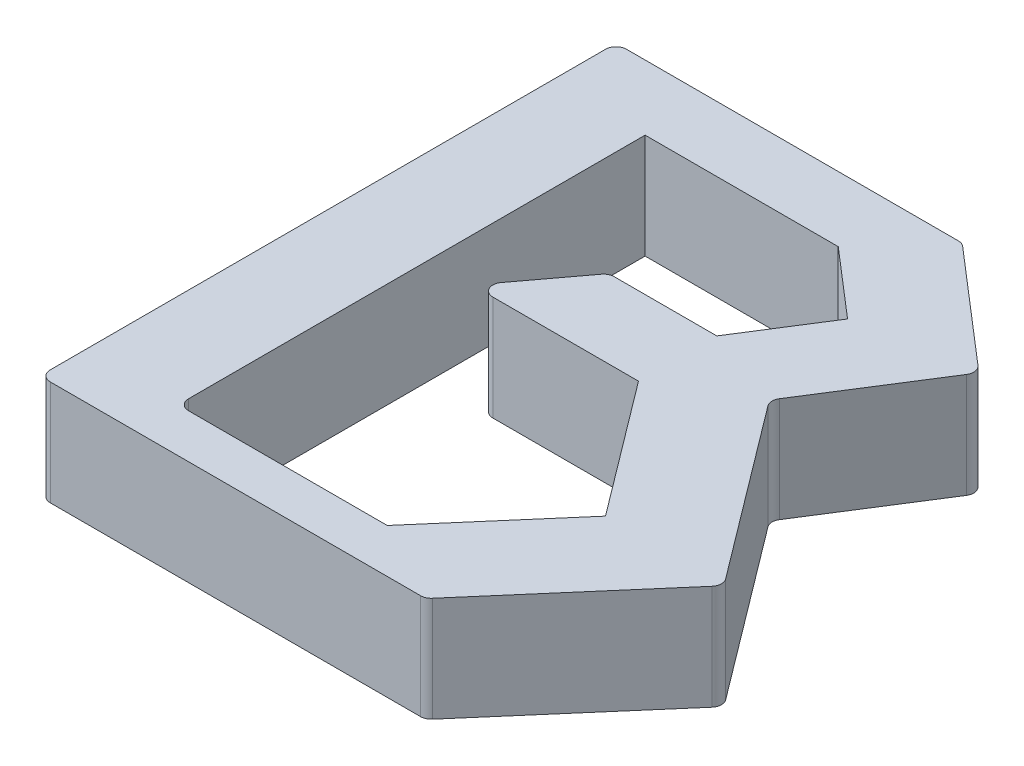
ISO-10303-21;
HEADER;
FILE_DESCRIPTION(('STEP AP214'),'2;1');
FILE_NAME('part.step','',(''),(''),'','','');
FILE_SCHEMA(('AUTOMOTIVE_DESIGN { 1 0 10303 214 1 1 1 1 }'));
ENDSEC;
DATA;
#1=APPLICATION_CONTEXT('core data for automotive mechanical design processes');
#2=APPLICATION_PROTOCOL_DEFINITION('international standard','automotive_design',2000,#1);
#3=PRODUCT_CONTEXT('',#1,'mechanical');
#4=PRODUCT('Part','Part','',(#3));
#5=PRODUCT_RELATED_PRODUCT_CATEGORY('part','',(#4));
#6=PRODUCT_DEFINITION_FORMATION('','',#4);
#7=PRODUCT_DEFINITION_CONTEXT('part definition',#1,'design');
#8=PRODUCT_DEFINITION('design','',#6,#7);
#9=PRODUCT_DEFINITION_SHAPE('','',#8);
#10=(LENGTH_UNIT() NAMED_UNIT(*) SI_UNIT(.MILLI.,.METRE.));
#11=(NAMED_UNIT(*) PLANE_ANGLE_UNIT() SI_UNIT($,.RADIAN.));
#12=(NAMED_UNIT(*) SI_UNIT($,.STERADIAN.) SOLID_ANGLE_UNIT());
#13=UNCERTAINTY_MEASURE_WITH_UNIT(LENGTH_MEASURE(1.E-05),#10,'distance_accuracy_value','');
#14=(GEOMETRIC_REPRESENTATION_CONTEXT(3) GLOBAL_UNCERTAINTY_ASSIGNED_CONTEXT((#13)) GLOBAL_UNIT_ASSIGNED_CONTEXT((#10,
#11,#12)) REPRESENTATION_CONTEXT('',''));
#15=CARTESIAN_POINT('',(0.,0.,0.));
#16=DIRECTION('',(0.,0.,1.));
#17=DIRECTION('',(1.,0.,0.));
#18=AXIS2_PLACEMENT_3D('',#15,#16,#17);
#19=CARTESIAN_POINT('',(0.,10.,0.));
#20=DIRECTION('',(0.,-1.,0.));
#21=DIRECTION('',(0.,0.,-1.));
#22=AXIS2_PLACEMENT_3D('',#19,#20,#21);
#23=PLANE('',#22);
#24=DIRECTION('',(0.534870419899119,0.,-0.844934100339749));
#25=VECTOR('',#24,1.);
#26=CARTESIAN_POINT('',(44.5679123680884,10.,-45.0706105082823));
#27=LINE('',#26,#25);
#28=CARTESIAN_POINT('',(37.1841867720434,10.,-33.4065488747627));
#29=VERTEX_POINT('',#28);
#30=CARTESIAN_POINT('',(44.1063470889876,10.,-44.3414764426546));
#31=VERTEX_POINT('',#30);
#32=EDGE_CURVE('E307',#29,#31,#27,.T.);
#33=ORIENTED_EDGE('',*,*,#32,.T.);
#34=CARTESIAN_POINT('',(43.2614129886479,10.,-44.8763468625537));
#35=DIRECTION('',(0.,-1.,0.));
#36=DIRECTION('',(0.,0.,-1.));
#37=AXIS2_PLACEMENT_3D('',#34,#35,#36);
#38=CIRCLE('',#37,1.);
#39=CARTESIAN_POINT('',(43.9141748943175,10.,-45.6339099916106));
#40=VERTEX_POINT('',#39);
#41=EDGE_CURVE('E375',#31,#40,#38,.F.);
#42=ORIENTED_EDGE('',*,*,#41,.T.);
#43=DIRECTION('',(-0.757563129056951,0.,-0.652761905669626));
#44=VECTOR('',#43,1.);
#45=CARTESIAN_POINT('',(33.0443548387097,10.,-55.));
#46=LINE('',#45,#44);
#47=CARTESIAN_POINT('',(33.3257150604922,10.,-54.7575631290569));
#48=VERTEX_POINT('',#47);
#49=EDGE_CURVE('E310',#40,#48,#46,.T.);
#50=ORIENTED_EDGE('',*,*,#49,.T.);
#51=CARTESIAN_POINT('',(32.6729531548226,10.,-54.));
#52=DIRECTION('',(0.,-1.,0.));
#53=DIRECTION('',(0.,0.,-1.));
#54=AXIS2_PLACEMENT_3D('',#51,#52,#53);
#55=CIRCLE('',#54,1.);
#56=CARTESIAN_POINT('',(32.6729531548226,10.,-55.));
#57=VERTEX_POINT('',#56);
#58=EDGE_CURVE('E361',#48,#57,#55,.F.);
#59=ORIENTED_EDGE('',*,*,#58,.T.);
#60=DIRECTION('',(-1.,0.,0.));
#61=VECTOR('',#60,1.);
#62=CARTESIAN_POINT('',(0.,10.,-55.));
#63=LINE('',#62,#61);
#64=CARTESIAN_POINT('',(1.,10.,-55.));
#65=VERTEX_POINT('',#64);
#66=EDGE_CURVE('E313',#57,#65,#63,.T.);
#67=ORIENTED_EDGE('',*,*,#66,.T.);
#68=CARTESIAN_POINT('',(1.,10.,-54.));
#69=DIRECTION('',(0.,-1.,0.));
#70=DIRECTION('',(0.,0.,-1.));
#71=AXIS2_PLACEMENT_3D('',#68,#69,#70);
#72=CIRCLE('',#71,1.);
#73=CARTESIAN_POINT('',(0.,10.,-54.));
#74=VERTEX_POINT('',#73);
#75=EDGE_CURVE('E363',#65,#74,#72,.F.);
#76=ORIENTED_EDGE('',*,*,#75,.T.);
#77=DIRECTION('',(0.,0.,1.));
#78=VECTOR('',#77,1.);
#79=CARTESIAN_POINT('',(0.,10.,0.));
#80=LINE('',#79,#78);
#81=CARTESIAN_POINT('',(0.,10.,-1.));
#82=VERTEX_POINT('',#81);
#83=EDGE_CURVE('E294',#74,#82,#80,.T.);
#84=ORIENTED_EDGE('',*,*,#83,.T.);
#85=CARTESIAN_POINT('',(1.,10.,-1.));
#86=DIRECTION('',(0.,-1.,0.));
#87=DIRECTION('',(0.,0.,-1.));
#88=AXIS2_PLACEMENT_3D('',#85,#86,#87);
#89=CIRCLE('',#88,1.);
#90=CARTESIAN_POINT('',(1.,10.,0.));
#91=VERTEX_POINT('',#90);
#92=EDGE_CURVE('E365',#82,#91,#89,.F.);
#93=ORIENTED_EDGE('',*,*,#92,.T.);
#94=DIRECTION('',(1.,0.,0.));
#95=VECTOR('',#94,1.);
#96=CARTESIAN_POINT('',(0.,10.,0.));
#97=LINE('',#96,#95);
#98=CARTESIAN_POINT('',(36.3561542037857,10.,0.));
#99=VERTEX_POINT('',#98);
#100=EDGE_CURVE('E297',#91,#99,#97,.T.);
#101=ORIENTED_EDGE('',*,*,#100,.T.);
#102=CARTESIAN_POINT('',(36.3561542037857,10.,-1.));
#103=DIRECTION('',(0.,-1.,0.));
#104=DIRECTION('',(0.,0.,-1.));
#105=AXIS2_PLACEMENT_3D('',#102,#103,#104);
#106=CIRCLE('',#105,1.);
#107=CARTESIAN_POINT('',(37.1137173328426,10.,-0.347238094330377));
#108=VERTEX_POINT('',#107);
#109=EDGE_CURVE('E373',#99,#108,#106,.F.);
#110=ORIENTED_EDGE('',*,*,#109,.T.);
#111=DIRECTION('',(0.652761905669626,0.,-0.757563129056951));
#112=VECTOR('',#111,1.);
#113=CARTESIAN_POINT('',(50.,10.,-15.3024193548387));
#114=LINE('',#113,#112);
#115=CARTESIAN_POINT('',(49.4740875818952,10.,-14.6920714567629));
#116=VERTEX_POINT('',#115);
#117=EDGE_CURVE('E301',#108,#116,#114,.T.);
#118=ORIENTED_EDGE('',*,*,#117,.T.);
#119=CARTESIAN_POINT('',(48.7165244528382,10.,-15.3448333624326));
#120=DIRECTION('',(0.,-1.,0.));
#121=DIRECTION('',(0.,0.,-1.));
#122=AXIS2_PLACEMENT_3D('',#119,#120,#121);
#123=CIRCLE('',#122,1.);
#124=CARTESIAN_POINT('',(49.5155303464269,10.,-15.9461565550758));
#125=VERTEX_POINT('',#124);
#126=EDGE_CURVE('E371',#116,#125,#123,.F.);
#127=ORIENTED_EDGE('',*,*,#126,.T.);
#128=DIRECTION('',(-0.601323192643225,0.,-0.799005893588626));
#129=VECTOR('',#128,1.);
#130=CARTESIAN_POINT('',(36.8145161290322,10.,-32.8225806451613));
#131=LINE('',#130,#129);
#132=CARTESIAN_POINT('',(37.2301149787945,10.,-32.2703552622203));
#133=VERTEX_POINT('',#132);
#134=EDGE_CURVE('E304',#125,#133,#131,.T.);
#135=ORIENTED_EDGE('',*,*,#134,.T.);
#136=CARTESIAN_POINT('',(38.0291208723831,10.,-32.8716784548635));
#137=DIRECTION('',(0.,-1.,0.));
#138=DIRECTION('',(0.,0.,-1.));
#139=AXIS2_PLACEMENT_3D('',#136,#137,#138);
#140=CIRCLE('',#139,1.);
#141=EDGE_CURVE('E417',#133,#29,#140,.T.);
#142=ORIENTED_EDGE('',*,*,#141,.T.);
#143=EDGE_LOOP('',(#33,#42,#50,#59,#67,#76,#84,#93,#101,#110,#118,#127,#135,#142));
#144=FACE_BOUND('',#143,.T.);
#145=DIRECTION('',(0.599203550404708,0.,-0.800596718193619));
#146=VECTOR('',#145,1.);
#147=CARTESIAN_POINT('',(13.1098148707565,10.,-28.1359668027432));
#148=LINE('',#147,#146);
#149=CARTESIAN_POINT('',(14.3067326490162,10.,-29.7351703531479));
#150=VERTEX_POINT('',#149);
#151=CARTESIAN_POINT('',(18.4049889788777,10.,-35.2108564798194));
#152=VERTEX_POINT('',#151);
#153=EDGE_CURVE('E248',#150,#152,#148,.T.);
#154=ORIENTED_EDGE('',*,*,#153,.F.);
#155=CARTESIAN_POINT('',(15.1073293672098,10.,-29.1359668027432));
#156=DIRECTION('',(0.,-1.,0.));
#157=DIRECTION('',(0.,0.,-1.));
#158=AXIS2_PLACEMENT_3D('',#155,#156,#157);
#159=CIRCLE('',#158,1.);
#160=CARTESIAN_POINT('',(15.1073293672098,10.,-28.1359668027432));
#161=VERTEX_POINT('',#160);
#162=EDGE_CURVE('E369',#150,#161,#159,.F.);
#163=ORIENTED_EDGE('',*,*,#162,.T.);
#164=DIRECTION('',(-1.,0.,0.));
#165=VECTOR('',#164,1.);
#166=CARTESIAN_POINT('',(13.1098148707565,10.,-28.1359668027432));
#167=LINE('',#166,#165);
#168=CARTESIAN_POINT('',(29.007221013889,10.,-28.1359668027432));
#169=VERTEX_POINT('',#168);
#170=EDGE_CURVE('E245',#169,#161,#167,.T.);
#171=ORIENTED_EDGE('',*,*,#170,.F.);
#172=DIRECTION('',(-0.601323192643225,0.,-0.799005893588627));
#173=VECTOR('',#172,1.);
#174=CARTESIAN_POINT('',(29.007221013889,10.,-28.1359668027432));
#175=LINE('',#174,#173);
#176=CARTESIAN_POINT('',(38.5894668716284,10.,-15.4035942486522));
#177=VERTEX_POINT('',#176);
#178=EDGE_CURVE('E243',#177,#169,#175,.T.);
#179=ORIENTED_EDGE('',*,*,#178,.F.);
#180=DIRECTION('',(0.652761905669626,0.,-0.757563129056951));
#181=VECTOR('',#180,1.);
#182=CARTESIAN_POINT('',(38.5894668716284,10.,-15.4035942486522));
#183=LINE('',#182,#181);
#184=CARTESIAN_POINT('',(28.947590047404,10.,-4.21370967741935));
#185=VERTEX_POINT('',#184);
#186=EDGE_CURVE('E239',#185,#177,#183,.T.);
#187=ORIENTED_EDGE('',*,*,#186,.F.);
#188=DIRECTION('',(1.,0.,0.));
#189=VECTOR('',#188,1.);
#190=CARTESIAN_POINT('',(28.947590047404,10.,-4.21370967741935));
#191=LINE('',#190,#189);
#192=CARTESIAN_POINT('',(9.9879126280492,10.,-4.21370967741935));
#193=VERTEX_POINT('',#192);
#194=EDGE_CURVE('E237',#193,#185,#191,.T.);
#195=ORIENTED_EDGE('',*,*,#194,.F.);
#196=CARTESIAN_POINT('',(9.98791262804919,10.,-5.21370967741935));
#197=DIRECTION('',(0.,-1.,0.));
#198=DIRECTION('',(0.,0.,-1.));
#199=AXIS2_PLACEMENT_3D('',#196,#197,#198);
#200=CIRCLE('',#199,1.);
#201=CARTESIAN_POINT('',(8.98791262804919,10.,-5.21370967741935));
#202=VERTEX_POINT('',#201);
#203=EDGE_CURVE('E11',#193,#202,#200,.T.);
#204=ORIENTED_EDGE('',*,*,#203,.T.);
#205=DIRECTION('',(0.,0.,1.));
#206=VECTOR('',#205,1.);
#207=CARTESIAN_POINT('',(8.98791262804918,10.,-48.7885141245915));
#208=LINE('',#207,#206);
#209=CARTESIAN_POINT('',(8.98791262804918,10.,-48.7885141245915));
#210=VERTEX_POINT('',#209);
#211=EDGE_CURVE('E224',#210,#202,#208,.T.);
#212=ORIENTED_EDGE('',*,*,#211,.F.);
#213=DIRECTION('',(-1.,0.,0.));
#214=VECTOR('',#213,1.);
#215=CARTESIAN_POINT('',(8.98791262804918,10.,-48.7885141245915));
#216=LINE('',#215,#214);
#217=CARTESIAN_POINT('',(27.4217174133645,10.,-48.7885141245915));
#218=VERTEX_POINT('',#217);
#219=EDGE_CURVE('E216',#218,#210,#216,.T.);
#220=ORIENTED_EDGE('',*,*,#219,.F.);
#221=DIRECTION('',(-0.757563129056952,0.,-0.652761905669625));
#222=VECTOR('',#221,1.);
#223=CARTESIAN_POINT('',(27.4217174133645,10.,-48.7885141245915));
#224=LINE('',#223,#222);
#225=CARTESIAN_POINT('',(33.8449762012233,10.,-43.2538484496776));
#226=VERTEX_POINT('',#225);
#227=EDGE_CURVE('E256',#226,#218,#224,.T.);
#228=ORIENTED_EDGE('',*,*,#227,.F.);
#229=DIRECTION('',(0.534870419899118,0.,-0.844934100339749));
#230=VECTOR('',#229,1.);
#231=CARTESIAN_POINT('',(33.8449762012233,10.,-43.2538484496776));
#232=LINE('',#231,#230);
#233=CARTESIAN_POINT('',(29.007221013889,10.,-35.6116529294147));
#234=VERTEX_POINT('',#233);
#235=EDGE_CURVE('E253',#234,#226,#232,.T.);
#236=ORIENTED_EDGE('',*,*,#235,.F.);
#237=DIRECTION('',(1.,0.,0.));
#238=VECTOR('',#237,1.);
#239=CARTESIAN_POINT('',(29.007221013889,10.,-35.6116529294147));
#240=LINE('',#239,#238);
#241=CARTESIAN_POINT('',(19.2055856970713,10.,-35.6116529294147));
#242=VERTEX_POINT('',#241);
#243=EDGE_CURVE('E251',#242,#234,#240,.T.);
#244=ORIENTED_EDGE('',*,*,#243,.F.);
#245=CARTESIAN_POINT('',(19.2055856970713,10.,-34.6116529294147));
#246=DIRECTION('',(0.,-1.,0.));
#247=DIRECTION('',(0.,0.,-1.));
#248=AXIS2_PLACEMENT_3D('',#245,#246,#247);
#249=CIRCLE('',#248,1.);
#250=EDGE_CURVE('E367',#242,#152,#249,.F.);
#251=ORIENTED_EDGE('',*,*,#250,.T.);
#252=EDGE_LOOP('',(#154,#163,#171,#179,#187,#195,#204,#212,#220,#228,#236,#244,#251));
#253=FACE_BOUND('',#252,.T.);
#254=ADVANCED_FACE('F36',(#144,#253),#23,.F.);
#255=CARTESIAN_POINT('',(0.,0.,0.));
#256=DIRECTION('',(0.,-1.,0.));
#257=DIRECTION('',(0.,0.,-1.));
#258=AXIS2_PLACEMENT_3D('',#255,#256,#257);
#259=PLANE('',#258);
#260=DIRECTION('',(-0.757563129056951,0.,-0.652761905669626));
#261=VECTOR('',#260,1.);
#262=CARTESIAN_POINT('',(33.0443548387097,0.,-55.));
#263=LINE('',#262,#261);
#264=CARTESIAN_POINT('',(43.9141748943175,0.,-45.6339099916106));
#265=VERTEX_POINT('',#264);
#266=CARTESIAN_POINT('',(33.3257150604922,0.,-54.7575631290569));
#267=VERTEX_POINT('',#266);
#268=EDGE_CURVE('E331',#265,#267,#263,.T.);
#269=ORIENTED_EDGE('',*,*,#268,.F.);
#270=CARTESIAN_POINT('',(43.2614129886479,0.,-44.8763468625537));
#271=DIRECTION('',(0.,-1.,0.));
#272=DIRECTION('',(0.,0.,-1.));
#273=AXIS2_PLACEMENT_3D('',#270,#271,#272);
#274=CIRCLE('',#273,1.);
#275=CARTESIAN_POINT('',(44.1063470889876,0.,-44.3414764426546));
#276=VERTEX_POINT('',#275);
#277=EDGE_CURVE('E354',#265,#276,#274,.T.);
#278=ORIENTED_EDGE('',*,*,#277,.T.);
#279=DIRECTION('',(0.534870419899119,0.,-0.844934100339749));
#280=VECTOR('',#279,1.);
#281=CARTESIAN_POINT('',(44.5679123680884,0.,-45.0706105082823));
#282=LINE('',#281,#280);
#283=CARTESIAN_POINT('',(37.1841867720434,0.,-33.4065488747627));
#284=VERTEX_POINT('',#283);
#285=EDGE_CURVE('E328',#284,#276,#282,.T.);
#286=ORIENTED_EDGE('',*,*,#285,.F.);
#287=CARTESIAN_POINT('',(38.0291208723831,0.,-32.8716784548635));
#288=DIRECTION('',(0.,-1.,0.));
#289=DIRECTION('',(0.,0.,-1.));
#290=AXIS2_PLACEMENT_3D('',#287,#288,#289);
#291=CIRCLE('',#290,1.);
#292=CARTESIAN_POINT('',(37.2301149787945,0.,-32.2703552622203));
#293=VERTEX_POINT('',#292);
#294=EDGE_CURVE('E415',#284,#293,#291,.F.);
#295=ORIENTED_EDGE('',*,*,#294,.T.);
#296=DIRECTION('',(-0.601323192643225,0.,-0.799005893588626));
#297=VECTOR('',#296,1.);
#298=CARTESIAN_POINT('',(36.8145161290322,0.,-32.8225806451613));
#299=LINE('',#298,#297);
#300=CARTESIAN_POINT('',(49.5155303464269,0.,-15.9461565550758));
#301=VERTEX_POINT('',#300);
#302=EDGE_CURVE('E325',#301,#293,#299,.T.);
#303=ORIENTED_EDGE('',*,*,#302,.F.);
#304=CARTESIAN_POINT('',(48.7165244528382,0.,-15.3448333624326));
#305=DIRECTION('',(0.,-1.,0.));
#306=DIRECTION('',(0.,0.,-1.));
#307=AXIS2_PLACEMENT_3D('',#304,#305,#306);
#308=CIRCLE('',#307,1.);
#309=CARTESIAN_POINT('',(49.4740875818952,0.,-14.6920714567629));
#310=VERTEX_POINT('',#309);
#311=EDGE_CURVE('E350',#301,#310,#308,.T.);
#312=ORIENTED_EDGE('',*,*,#311,.T.);
#313=DIRECTION('',(0.652761905669626,0.,-0.757563129056951));
#314=VECTOR('',#313,1.);
#315=CARTESIAN_POINT('',(50.,0.,-15.3024193548387));
#316=LINE('',#315,#314);
#317=CARTESIAN_POINT('',(37.1137173328426,0.,-0.347238094330377));
#318=VERTEX_POINT('',#317);
#319=EDGE_CURVE('E322',#318,#310,#316,.T.);
#320=ORIENTED_EDGE('',*,*,#319,.F.);
#321=CARTESIAN_POINT('',(36.3561542037857,0.,-1.));
#322=DIRECTION('',(0.,-1.,0.));
#323=DIRECTION('',(0.,0.,-1.));
#324=AXIS2_PLACEMENT_3D('',#321,#322,#323);
#325=CIRCLE('',#324,1.);
#326=CARTESIAN_POINT('',(36.3561542037857,0.,0.));
#327=VERTEX_POINT('',#326);
#328=EDGE_CURVE('E352',#318,#327,#325,.T.);
#329=ORIENTED_EDGE('',*,*,#328,.T.);
#330=DIRECTION('',(1.,0.,0.));
#331=VECTOR('',#330,1.);
#332=CARTESIAN_POINT('',(0.,0.,0.));
#333=LINE('',#332,#331);
#334=CARTESIAN_POINT('',(1.,0.,0.));
#335=VERTEX_POINT('',#334);
#336=EDGE_CURVE('E319',#335,#327,#333,.T.);
#337=ORIENTED_EDGE('',*,*,#336,.F.);
#338=CARTESIAN_POINT('',(1.,0.,-1.));
#339=DIRECTION('',(0.,-1.,0.));
#340=DIRECTION('',(0.,0.,-1.));
#341=AXIS2_PLACEMENT_3D('',#338,#339,#340);
#342=CIRCLE('',#341,1.);
#343=CARTESIAN_POINT('',(0.,0.,-1.));
#344=VERTEX_POINT('',#343);
#345=EDGE_CURVE('E344',#335,#344,#342,.T.);
#346=ORIENTED_EDGE('',*,*,#345,.T.);
#347=DIRECTION('',(0.,0.,1.));
#348=VECTOR('',#347,1.);
#349=CARTESIAN_POINT('',(0.,0.,0.));
#350=LINE('',#349,#348);
#351=CARTESIAN_POINT('',(0.,0.,-54.));
#352=VERTEX_POINT('',#351);
#353=EDGE_CURVE('E233',#352,#344,#350,.T.);
#354=ORIENTED_EDGE('',*,*,#353,.F.);
#355=CARTESIAN_POINT('',(1.,0.,-54.));
#356=DIRECTION('',(0.,-1.,0.));
#357=DIRECTION('',(0.,0.,-1.));
#358=AXIS2_PLACEMENT_3D('',#355,#356,#357);
#359=CIRCLE('',#358,1.);
#360=CARTESIAN_POINT('',(1.,0.,-55.));
#361=VERTEX_POINT('',#360);
#362=EDGE_CURVE('E342',#352,#361,#359,.T.);
#363=ORIENTED_EDGE('',*,*,#362,.T.);
#364=DIRECTION('',(-1.,0.,0.));
#365=VECTOR('',#364,1.);
#366=CARTESIAN_POINT('',(0.,0.,-55.));
#367=LINE('',#366,#365);
#368=CARTESIAN_POINT('',(32.6729531548226,0.,-55.));
#369=VERTEX_POINT('',#368);
#370=EDGE_CURVE('E298',#369,#361,#367,.T.);
#371=ORIENTED_EDGE('',*,*,#370,.F.);
#372=CARTESIAN_POINT('',(32.6729531548226,0.,-54.));
#373=DIRECTION('',(0.,-1.,0.));
#374=DIRECTION('',(0.,0.,-1.));
#375=AXIS2_PLACEMENT_3D('',#372,#373,#374);
#376=CIRCLE('',#375,1.);
#377=EDGE_CURVE('E340',#369,#267,#376,.T.);
#378=ORIENTED_EDGE('',*,*,#377,.T.);
#379=EDGE_LOOP('',(#269,#278,#286,#295,#303,#312,#320,#329,#337,#346,#354,#363,#371,#378));
#380=FACE_BOUND('',#379,.T.);
#381=DIRECTION('',(-1.,0.,0.));
#382=VECTOR('',#381,1.);
#383=CARTESIAN_POINT('',(13.1098148707565,0.,-28.1359668027432));
#384=LINE('',#383,#382);
#385=CARTESIAN_POINT('',(29.007221013889,0.,-28.1359668027432));
#386=VERTEX_POINT('',#385);
#387=CARTESIAN_POINT('',(15.1073293672098,0.,-28.1359668027432));
#388=VERTEX_POINT('',#387);
#389=EDGE_CURVE('E269',#386,#388,#384,.T.);
#390=ORIENTED_EDGE('',*,*,#389,.T.);
#391=CARTESIAN_POINT('',(15.1073293672098,0.,-29.1359668027432));
#392=DIRECTION('',(0.,-1.,0.));
#393=DIRECTION('',(0.,0.,-1.));
#394=AXIS2_PLACEMENT_3D('',#391,#392,#393);
#395=CIRCLE('',#394,1.);
#396=CARTESIAN_POINT('',(14.3067326490162,0.,-29.7351703531479));
#397=VERTEX_POINT('',#396);
#398=EDGE_CURVE('E348',#388,#397,#395,.T.);
#399=ORIENTED_EDGE('',*,*,#398,.T.);
#400=DIRECTION('',(0.599203550404708,0.,-0.800596718193619));
#401=VECTOR('',#400,1.);
#402=CARTESIAN_POINT('',(13.1098148707565,0.,-28.1359668027432));
#403=LINE('',#402,#401);
#404=CARTESIAN_POINT('',(18.4049889788777,0.,-35.2108564798194));
#405=VERTEX_POINT('',#404);
#406=EDGE_CURVE('E272',#397,#405,#403,.T.);
#407=ORIENTED_EDGE('',*,*,#406,.T.);
#408=CARTESIAN_POINT('',(19.2055856970713,0.,-34.6116529294147));
#409=DIRECTION('',(0.,-1.,0.));
#410=DIRECTION('',(0.,0.,-1.));
#411=AXIS2_PLACEMENT_3D('',#408,#409,#410);
#412=CIRCLE('',#411,1.);
#413=CARTESIAN_POINT('',(19.2055856970713,0.,-35.6116529294147));
#414=VERTEX_POINT('',#413);
#415=EDGE_CURVE('E346',#405,#414,#412,.T.);
#416=ORIENTED_EDGE('',*,*,#415,.T.);
#417=DIRECTION('',(1.,0.,0.));
#418=VECTOR('',#417,1.);
#419=CARTESIAN_POINT('',(29.007221013889,0.,-35.6116529294147));
#420=LINE('',#419,#418);
#421=CARTESIAN_POINT('',(29.007221013889,0.,-35.6116529294147));
#422=VERTEX_POINT('',#421);
#423=EDGE_CURVE('E275',#414,#422,#420,.T.);
#424=ORIENTED_EDGE('',*,*,#423,.T.);
#425=DIRECTION('',(0.534870419899118,0.,-0.844934100339749));
#426=VECTOR('',#425,1.);
#427=CARTESIAN_POINT('',(33.8449762012233,0.,-43.2538484496776));
#428=LINE('',#427,#426);
#429=CARTESIAN_POINT('',(33.8449762012233,0.,-43.2538484496776));
#430=VERTEX_POINT('',#429);
#431=EDGE_CURVE('E277',#422,#430,#428,.T.);
#432=ORIENTED_EDGE('',*,*,#431,.T.);
#433=DIRECTION('',(-0.757563129056952,0.,-0.652761905669625));
#434=VECTOR('',#433,1.);
#435=CARTESIAN_POINT('',(27.4217174133645,0.,-48.7885141245915));
#436=LINE('',#435,#434);
#437=CARTESIAN_POINT('',(27.4217174133645,0.,-48.7885141245915));
#438=VERTEX_POINT('',#437);
#439=EDGE_CURVE('E225',#430,#438,#436,.T.);
#440=ORIENTED_EDGE('',*,*,#439,.T.);
#441=DIRECTION('',(-1.,0.,0.));
#442=VECTOR('',#441,1.);
#443=CARTESIAN_POINT('',(8.98791262804918,0.,-48.7885141245915));
#444=LINE('',#443,#442);
#445=CARTESIAN_POINT('',(8.98791262804918,0.,-48.7885141245915));
#446=VERTEX_POINT('',#445);
#447=EDGE_CURVE('E258',#438,#446,#444,.T.);
#448=ORIENTED_EDGE('',*,*,#447,.T.);
#449=DIRECTION('',(0.,0.,1.));
#450=VECTOR('',#449,1.);
#451=CARTESIAN_POINT('',(8.98791262804918,0.,-48.7885141245915));
#452=LINE('',#451,#450);
#453=CARTESIAN_POINT('',(8.98791262804919,0.,-5.21370967741935));
#454=VERTEX_POINT('',#453);
#455=EDGE_CURVE('E232',#446,#454,#452,.T.);
#456=ORIENTED_EDGE('',*,*,#455,.T.);
#457=CARTESIAN_POINT('',(9.98791262804919,0.,-5.21370967741935));
#458=DIRECTION('',(0.,-1.,0.));
#459=DIRECTION('',(0.,0.,-1.));
#460=AXIS2_PLACEMENT_3D('',#457,#458,#459);
#461=CIRCLE('',#460,1.);
#462=CARTESIAN_POINT('',(9.9879126280492,0.,-4.21370967741935));
#463=VERTEX_POINT('',#462);
#464=EDGE_CURVE('E44',#454,#463,#461,.F.);
#465=ORIENTED_EDGE('',*,*,#464,.T.);
#466=DIRECTION('',(1.,0.,0.));
#467=VECTOR('',#466,1.);
#468=CARTESIAN_POINT('',(28.947590047404,0.,-4.21370967741935));
#469=LINE('',#468,#467);
#470=CARTESIAN_POINT('',(28.947590047404,0.,-4.21370967741935));
#471=VERTEX_POINT('',#470);
#472=EDGE_CURVE('E261',#463,#471,#469,.T.);
#473=ORIENTED_EDGE('',*,*,#472,.T.);
#474=DIRECTION('',(0.652761905669626,0.,-0.757563129056951));
#475=VECTOR('',#474,1.);
#476=CARTESIAN_POINT('',(38.5894668716284,0.,-15.4035942486522));
#477=LINE('',#476,#475);
#478=CARTESIAN_POINT('',(38.5894668716284,0.,-15.4035942486522));
#479=VERTEX_POINT('',#478);
#480=EDGE_CURVE('E263',#471,#479,#477,.T.);
#481=ORIENTED_EDGE('',*,*,#480,.T.);
#482=DIRECTION('',(-0.601323192643225,0.,-0.799005893588627));
#483=VECTOR('',#482,1.);
#484=CARTESIAN_POINT('',(29.007221013889,0.,-28.1359668027432));
#485=LINE('',#484,#483);
#486=EDGE_CURVE('E266',#479,#386,#485,.T.);
#487=ORIENTED_EDGE('',*,*,#486,.T.);
#488=EDGE_LOOP('',(#390,#399,#407,#416,#424,#432,#440,#448,#456,#465,#473,#481,#487));
#489=FACE_BOUND('',#488,.T.);
#490=ADVANCED_FACE('F419',(#380,#489),#259,.T.);
#491=CARTESIAN_POINT('',(0.,10.,0.));
#492=DIRECTION('',(1.,0.,0.));
#493=DIRECTION('',(0.,0.,-1.));
#494=AXIS2_PLACEMENT_3D('',#491,#492,#493);
#495=PLANE('',#494);
#496=ORIENTED_EDGE('',*,*,#353,.T.);
#497=DIRECTION('',(0.,-1.,0.));
#498=VECTOR('',#497,1.);
#499=CARTESIAN_POINT('',(0.,10.,-1.));
#500=LINE('',#499,#498);
#501=EDGE_CURVE('E405',#344,#82,#500,.F.);
#502=ORIENTED_EDGE('',*,*,#501,.T.);
#503=ORIENTED_EDGE('',*,*,#83,.F.);
#504=DIRECTION('',(0.,-1.,0.));
#505=VECTOR('',#504,1.);
#506=CARTESIAN_POINT('',(0.,10.,-54.));
#507=LINE('',#506,#505);
#508=EDGE_CURVE('E402',#74,#352,#507,.T.);
#509=ORIENTED_EDGE('',*,*,#508,.T.);
#510=EDGE_LOOP('',(#496,#502,#503,#509));
#511=FACE_BOUND('',#510,.T.);
#512=ADVANCED_FACE('F437',(#511),#495,.F.);
#513=CARTESIAN_POINT('',(0.,10.,0.));
#514=DIRECTION('',(0.,0.,-1.));
#515=DIRECTION('',(-1.,0.,0.));
#516=AXIS2_PLACEMENT_3D('',#513,#514,#515);
#517=PLANE('',#516);
#518=ORIENTED_EDGE('',*,*,#336,.T.);
#519=DIRECTION('',(0.,-1.,0.));
#520=VECTOR('',#519,1.);
#521=CARTESIAN_POINT('',(36.3561542037857,10.,0.));
#522=LINE('',#521,#520);
#523=EDGE_CURVE('E385',#327,#99,#522,.F.);
#524=ORIENTED_EDGE('',*,*,#523,.T.);
#525=ORIENTED_EDGE('',*,*,#100,.F.);
#526=DIRECTION('',(0.,-1.,0.));
#527=VECTOR('',#526,1.);
#528=CARTESIAN_POINT('',(1.,10.,0.));
#529=LINE('',#528,#527);
#530=EDGE_CURVE('E382',#91,#335,#529,.T.);
#531=ORIENTED_EDGE('',*,*,#530,.T.);
#532=EDGE_LOOP('',(#518,#524,#525,#531));
#533=FACE_BOUND('',#532,.T.);
#534=ADVANCED_FACE('F462',(#533),#517,.F.);
#535=CARTESIAN_POINT('',(50.,10.,-15.3024193548387));
#536=DIRECTION('',(-0.757563129056951,0.,-0.652761905669626));
#537=DIRECTION('',(-0.652761905669626,0.,0.757563129056951));
#538=AXIS2_PLACEMENT_3D('',#535,#536,#537);
#539=PLANE('',#538);
#540=ORIENTED_EDGE('',*,*,#117,.F.);
#541=DIRECTION('',(0.,-1.,0.));
#542=VECTOR('',#541,1.);
#543=CARTESIAN_POINT('',(37.1137173328426,10.,-0.347238094330375));
#544=LINE('',#543,#542);
#545=EDGE_CURVE('E379',#108,#318,#544,.T.);
#546=ORIENTED_EDGE('',*,*,#545,.T.);
#547=ORIENTED_EDGE('',*,*,#319,.T.);
#548=DIRECTION('',(0.,-1.,0.));
#549=VECTOR('',#548,1.);
#550=CARTESIAN_POINT('',(49.4740875818952,10.,-14.6920714567629));
#551=LINE('',#550,#549);
#552=EDGE_CURVE('E377',#310,#116,#551,.F.);
#553=ORIENTED_EDGE('',*,*,#552,.T.);
#554=EDGE_LOOP('',(#540,#546,#547,#553));
#555=FACE_BOUND('',#554,.T.);
#556=ADVANCED_FACE('F458',(#555),#539,.F.);
#557=CARTESIAN_POINT('',(36.8145161290322,10.,-32.8225806451613));
#558=DIRECTION('',(-0.799005893588626,0.,0.601323192643225));
#559=DIRECTION('',(0.601323192643225,0.,0.799005893588626));
#560=AXIS2_PLACEMENT_3D('',#557,#558,#559);
#561=PLANE('',#560);
#562=ORIENTED_EDGE('',*,*,#134,.F.);
#563=DIRECTION('',(0.,-1.,0.));
#564=VECTOR('',#563,1.);
#565=CARTESIAN_POINT('',(49.5155303464269,10.,-15.9461565550758));
#566=LINE('',#565,#564);
#567=EDGE_CURVE('E389',#125,#301,#566,.T.);
#568=ORIENTED_EDGE('',*,*,#567,.T.);
#569=ORIENTED_EDGE('',*,*,#302,.T.);
#570=DIRECTION('',(0.,-1.,0.));
#571=VECTOR('',#570,1.);
#572=CARTESIAN_POINT('',(37.2301149787945,10.,-32.2703552622203));
#573=LINE('',#572,#571);
#574=EDGE_CURVE('E387',#293,#133,#573,.F.);
#575=ORIENTED_EDGE('',*,*,#574,.T.);
#576=EDGE_LOOP('',(#562,#568,#569,#575));
#577=FACE_BOUND('',#576,.T.);
#578=ADVANCED_FACE('F454',(#577),#561,.F.);
#579=CARTESIAN_POINT('',(44.5679123680884,10.,-45.0706105082823));
#580=DIRECTION('',(-0.844934100339749,0.,-0.534870419899119));
#581=DIRECTION('',(-0.534870419899119,0.,0.844934100339749));
#582=AXIS2_PLACEMENT_3D('',#579,#580,#581);
#583=PLANE('',#582);
#584=ORIENTED_EDGE('',*,*,#285,.T.);
#585=DIRECTION('',(0.,-1.,0.));
#586=VECTOR('',#585,1.);
#587=CARTESIAN_POINT('',(44.1063470889876,10.,-44.3414764426546));
#588=LINE('',#587,#586);
#589=EDGE_CURVE('E359',#276,#31,#588,.F.);
#590=ORIENTED_EDGE('',*,*,#589,.T.);
#591=ORIENTED_EDGE('',*,*,#32,.F.);
#592=DIRECTION('',(0.,-1.,0.));
#593=VECTOR('',#592,1.);
#594=CARTESIAN_POINT('',(37.1841867720434,0.,-33.4065488747626));
#595=LINE('',#594,#593);
#596=EDGE_CURVE('E356',#29,#284,#595,.T.);
#597=ORIENTED_EDGE('',*,*,#596,.T.);
#598=EDGE_LOOP('',(#584,#590,#591,#597));
#599=FACE_BOUND('',#598,.T.);
#600=ADVANCED_FACE('F450',(#599),#583,.F.);
#601=CARTESIAN_POINT('',(33.0443548387097,10.,-55.));
#602=DIRECTION('',(-0.652761905669626,0.,0.757563129056951));
#603=DIRECTION('',(0.757563129056951,0.,0.652761905669626));
#604=AXIS2_PLACEMENT_3D('',#601,#602,#603);
#605=PLANE('',#604);
#606=ORIENTED_EDGE('',*,*,#49,.F.);
#607=DIRECTION('',(0.,-1.,0.));
#608=VECTOR('',#607,1.);
#609=CARTESIAN_POINT('',(43.9141748943175,10.,-45.6339099916106));
#610=LINE('',#609,#608);
#611=EDGE_CURVE('E337',#40,#265,#610,.T.);
#612=ORIENTED_EDGE('',*,*,#611,.T.);
#613=ORIENTED_EDGE('',*,*,#268,.T.);
#614=DIRECTION('',(0.,-1.,0.));
#615=VECTOR('',#614,1.);
#616=CARTESIAN_POINT('',(33.3257150604922,10.,-54.7575631290569));
#617=LINE('',#616,#615);
#618=EDGE_CURVE('E316',#267,#48,#617,.F.);
#619=ORIENTED_EDGE('',*,*,#618,.T.);
#620=EDGE_LOOP('',(#606,#612,#613,#619));
#621=FACE_BOUND('',#620,.T.);
#622=ADVANCED_FACE('F446',(#621),#605,.F.);
#623=CARTESIAN_POINT('',(0.,10.,-55.));
#624=DIRECTION('',(0.,0.,1.));
#625=DIRECTION('',(1.,0.,0.));
#626=AXIS2_PLACEMENT_3D('',#623,#624,#625);
#627=PLANE('',#626);
#628=ORIENTED_EDGE('',*,*,#370,.T.);
#629=DIRECTION('',(0.,-1.,0.));
#630=VECTOR('',#629,1.);
#631=CARTESIAN_POINT('',(1.,10.,-55.));
#632=LINE('',#631,#630);
#633=EDGE_CURVE('E410',#361,#65,#632,.F.);
#634=ORIENTED_EDGE('',*,*,#633,.T.);
#635=ORIENTED_EDGE('',*,*,#66,.F.);
#636=DIRECTION('',(0.,-1.,0.));
#637=VECTOR('',#636,1.);
#638=CARTESIAN_POINT('',(32.6729531548226,10.,-55.));
#639=LINE('',#638,#637);
#640=EDGE_CURVE('E407',#57,#369,#639,.T.);
#641=ORIENTED_EDGE('',*,*,#640,.T.);
#642=EDGE_LOOP('',(#628,#634,#635,#641));
#643=FACE_BOUND('',#642,.T.);
#644=ADVANCED_FACE('F443',(#643),#627,.F.);
#645=CARTESIAN_POINT('',(8.98791262804918,10.,-48.7885141245915));
#646=DIRECTION('',(0.,0.,1.));
#647=DIRECTION('',(1.,0.,0.));
#648=AXIS2_PLACEMENT_3D('',#645,#646,#647);
#649=PLANE('',#648);
#650=ORIENTED_EDGE('',*,*,#447,.F.);
#651=DIRECTION('',(0.,-1.,0.));
#652=VECTOR('',#651,1.);
#653=CARTESIAN_POINT('',(27.4217174133645,10.,-48.7885141245915));
#654=LINE('',#653,#652);
#655=EDGE_CURVE('E222',#218,#438,#654,.T.);
#656=ORIENTED_EDGE('',*,*,#655,.F.);
#657=ORIENTED_EDGE('',*,*,#219,.T.);
#658=DIRECTION('',(0.,-1.,0.));
#659=VECTOR('',#658,1.);
#660=CARTESIAN_POINT('',(8.98791262804918,10.,-48.7885141245915));
#661=LINE('',#660,#659);
#662=EDGE_CURVE('E219',#210,#446,#661,.T.);
#663=ORIENTED_EDGE('',*,*,#662,.T.);
#664=EDGE_LOOP('',(#650,#656,#657,#663));
#665=FACE_BOUND('',#664,.T.);
#666=ADVANCED_FACE('F218',(#665),#649,.T.);
#667=CARTESIAN_POINT('',(8.98791262804918,10.,-48.7885141245915));
#668=DIRECTION('',(1.,0.,0.));
#669=DIRECTION('',(0.,0.,-1.));
#670=AXIS2_PLACEMENT_3D('',#667,#668,#669);
#671=PLANE('',#670);
#672=ORIENTED_EDGE('',*,*,#211,.T.);
#673=DIRECTION('',(0.,-1.,0.));
#674=VECTOR('',#673,1.);
#675=CARTESIAN_POINT('',(8.98791262804919,0.,-5.21370967741935));
#676=LINE('',#675,#674);
#677=EDGE_CURVE('E412',#202,#454,#676,.T.);
#678=ORIENTED_EDGE('',*,*,#677,.T.);
#679=ORIENTED_EDGE('',*,*,#455,.F.);
#680=ORIENTED_EDGE('',*,*,#662,.F.);
#681=EDGE_LOOP('',(#672,#678,#679,#680));
#682=FACE_BOUND('',#681,.T.);
#683=ADVANCED_FACE('F228',(#682),#671,.T.);
#684=CARTESIAN_POINT('',(28.947590047404,10.,-4.21370967741935));
#685=DIRECTION('',(0.,0.,-1.));
#686=DIRECTION('',(-1.,0.,0.));
#687=AXIS2_PLACEMENT_3D('',#684,#685,#686);
#688=PLANE('',#687);
#689=ORIENTED_EDGE('',*,*,#472,.F.);
#690=DIRECTION('',(0.,-1.,0.));
#691=VECTOR('',#690,1.);
#692=CARTESIAN_POINT('',(9.98791262804919,10.,-4.21370967741935));
#693=LINE('',#692,#691);
#694=EDGE_CURVE('E57',#463,#193,#693,.F.);
#695=ORIENTED_EDGE('',*,*,#694,.T.);
#696=ORIENTED_EDGE('',*,*,#194,.T.);
#697=DIRECTION('',(0.,-1.,0.));
#698=VECTOR('',#697,1.);
#699=CARTESIAN_POINT('',(28.947590047404,10.,-4.21370967741935));
#700=LINE('',#699,#698);
#701=EDGE_CURVE('E234',#185,#471,#700,.T.);
#702=ORIENTED_EDGE('',*,*,#701,.T.);
#703=EDGE_LOOP('',(#689,#695,#696,#702));
#704=FACE_BOUND('',#703,.T.);
#705=ADVANCED_FACE('F421',(#704),#688,.T.);
#706=CARTESIAN_POINT('',(38.5894668716284,10.,-15.4035942486522));
#707=DIRECTION('',(-0.757563129056951,0.,-0.652761905669626));
#708=DIRECTION('',(-0.652761905669626,0.,0.757563129056951));
#709=AXIS2_PLACEMENT_3D('',#706,#707,#708);
#710=PLANE('',#709);
#711=ORIENTED_EDGE('',*,*,#480,.F.);
#712=ORIENTED_EDGE('',*,*,#701,.F.);
#713=ORIENTED_EDGE('',*,*,#186,.T.);
#714=DIRECTION('',(0.,-1.,0.));
#715=VECTOR('',#714,1.);
#716=CARTESIAN_POINT('',(38.5894668716284,10.,-15.4035942486522));
#717=LINE('',#716,#715);
#718=EDGE_CURVE('E290',#177,#479,#717,.T.);
#719=ORIENTED_EDGE('',*,*,#718,.T.);
#720=EDGE_LOOP('',(#711,#712,#713,#719));
#721=FACE_BOUND('',#720,.T.);
#722=ADVANCED_FACE('F640',(#721),#710,.T.);
#723=CARTESIAN_POINT('',(29.007221013889,10.,-28.1359668027432));
#724=DIRECTION('',(-0.799005893588627,0.,0.601323192643225));
#725=DIRECTION('',(0.601323192643225,0.,0.799005893588627));
#726=AXIS2_PLACEMENT_3D('',#723,#724,#725);
#727=PLANE('',#726);
#728=ORIENTED_EDGE('',*,*,#486,.F.);
#729=ORIENTED_EDGE('',*,*,#718,.F.);
#730=ORIENTED_EDGE('',*,*,#178,.T.);
#731=DIRECTION('',(0.,-1.,0.));
#732=VECTOR('',#731,1.);
#733=CARTESIAN_POINT('',(29.007221013889,10.,-28.1359668027432));
#734=LINE('',#733,#732);
#735=EDGE_CURVE('E288',#169,#386,#734,.T.);
#736=ORIENTED_EDGE('',*,*,#735,.T.);
#737=EDGE_LOOP('',(#728,#729,#730,#736));
#738=FACE_BOUND('',#737,.T.);
#739=ADVANCED_FACE('F631',(#738),#727,.T.);
#740=CARTESIAN_POINT('',(13.1098148707565,10.,-28.1359668027432));
#741=DIRECTION('',(0.,0.,1.));
#742=DIRECTION('',(1.,0.,0.));
#743=AXIS2_PLACEMENT_3D('',#740,#741,#742);
#744=PLANE('',#743);
#745=ORIENTED_EDGE('',*,*,#170,.T.);
#746=DIRECTION('',(0.,-1.,0.));
#747=VECTOR('',#746,1.);
#748=CARTESIAN_POINT('',(15.1073293672098,10.,-28.1359668027432));
#749=LINE('',#748,#747);
#750=EDGE_CURVE('E392',#161,#388,#749,.T.);
#751=ORIENTED_EDGE('',*,*,#750,.T.);
#752=ORIENTED_EDGE('',*,*,#389,.F.);
#753=ORIENTED_EDGE('',*,*,#735,.F.);
#754=EDGE_LOOP('',(#745,#751,#752,#753));
#755=FACE_BOUND('',#754,.T.);
#756=ADVANCED_FACE('F622',(#755),#744,.T.);
#757=CARTESIAN_POINT('',(13.1098148707565,10.,-28.1359668027432));
#758=DIRECTION('',(-0.800596718193619,0.,-0.599203550404708));
#759=DIRECTION('',(-0.599203550404708,0.,0.800596718193619));
#760=AXIS2_PLACEMENT_3D('',#757,#758,#759);
#761=PLANE('',#760);
#762=ORIENTED_EDGE('',*,*,#406,.F.);
#763=DIRECTION('',(0.,-1.,0.));
#764=VECTOR('',#763,1.);
#765=CARTESIAN_POINT('',(14.3067326490162,10.,-29.7351703531479));
#766=LINE('',#765,#764);
#767=EDGE_CURVE('E398',#397,#150,#766,.F.);
#768=ORIENTED_EDGE('',*,*,#767,.T.);
#769=ORIENTED_EDGE('',*,*,#153,.T.);
#770=DIRECTION('',(0.,-1.,0.));
#771=VECTOR('',#770,1.);
#772=CARTESIAN_POINT('',(18.4049889788777,10.,-35.2108564798194));
#773=LINE('',#772,#771);
#774=EDGE_CURVE('E395',#152,#405,#773,.T.);
#775=ORIENTED_EDGE('',*,*,#774,.T.);
#776=EDGE_LOOP('',(#762,#768,#769,#775));
#777=FACE_BOUND('',#776,.T.);
#778=ADVANCED_FACE('F613',(#777),#761,.T.);
#779=CARTESIAN_POINT('',(29.007221013889,10.,-35.6116529294147));
#780=DIRECTION('',(0.,0.,-1.));
#781=DIRECTION('',(-1.,0.,0.));
#782=AXIS2_PLACEMENT_3D('',#779,#780,#781);
#783=PLANE('',#782);
#784=ORIENTED_EDGE('',*,*,#423,.F.);
#785=DIRECTION('',(0.,-1.,0.));
#786=VECTOR('',#785,1.);
#787=CARTESIAN_POINT('',(19.2055856970713,10.,-35.6116529294147));
#788=LINE('',#787,#786);
#789=EDGE_CURVE('E400',#414,#242,#788,.F.);
#790=ORIENTED_EDGE('',*,*,#789,.T.);
#791=ORIENTED_EDGE('',*,*,#243,.T.);
#792=DIRECTION('',(0.,-1.,0.));
#793=VECTOR('',#792,1.);
#794=CARTESIAN_POINT('',(29.007221013889,10.,-35.6116529294147));
#795=LINE('',#794,#793);
#796=EDGE_CURVE('E285',#234,#422,#795,.T.);
#797=ORIENTED_EDGE('',*,*,#796,.T.);
#798=EDGE_LOOP('',(#784,#790,#791,#797));
#799=FACE_BOUND('',#798,.T.);
#800=ADVANCED_FACE('F604',(#799),#783,.T.);
#801=CARTESIAN_POINT('',(33.8449762012233,10.,-43.2538484496776));
#802=DIRECTION('',(-0.844934100339749,0.,-0.534870419899118));
#803=DIRECTION('',(-0.534870419899118,0.,0.844934100339749));
#804=AXIS2_PLACEMENT_3D('',#801,#802,#803);
#805=PLANE('',#804);
#806=ORIENTED_EDGE('',*,*,#431,.F.);
#807=ORIENTED_EDGE('',*,*,#796,.F.);
#808=ORIENTED_EDGE('',*,*,#235,.T.);
#809=DIRECTION('',(0.,-1.,0.));
#810=VECTOR('',#809,1.);
#811=CARTESIAN_POINT('',(33.8449762012233,10.,-43.2538484496776));
#812=LINE('',#811,#810);
#813=EDGE_CURVE('E283',#226,#430,#812,.T.);
#814=ORIENTED_EDGE('',*,*,#813,.T.);
#815=EDGE_LOOP('',(#806,#807,#808,#814));
#816=FACE_BOUND('',#815,.T.);
#817=ADVANCED_FACE('F595',(#816),#805,.T.);
#818=CARTESIAN_POINT('',(27.4217174133645,10.,-48.7885141245915));
#819=DIRECTION('',(-0.652761905669625,0.,0.757563129056952));
#820=DIRECTION('',(0.757563129056952,0.,0.652761905669625));
#821=AXIS2_PLACEMENT_3D('',#818,#819,#820);
#822=PLANE('',#821);
#823=ORIENTED_EDGE('',*,*,#439,.F.);
#824=ORIENTED_EDGE('',*,*,#813,.F.);
#825=ORIENTED_EDGE('',*,*,#227,.T.);
#826=ORIENTED_EDGE('',*,*,#655,.T.);
#827=EDGE_LOOP('',(#823,#824,#825,#826));
#828=FACE_BOUND('',#827,.T.);
#829=ADVANCED_FACE('F474',(#828),#822,.T.);
#830=CARTESIAN_POINT('',(43.2614129886479,10.,-44.8763468625537));
#831=DIRECTION('',(0.,-1.,0.));
#832=DIRECTION('',(0.,0.,-1.));
#833=AXIS2_PLACEMENT_3D('',#830,#831,#832);
#834=CYLINDRICAL_SURFACE('',#833,1.);
#835=ORIENTED_EDGE('',*,*,#41,.F.);
#836=ORIENTED_EDGE('',*,*,#589,.F.);
#837=ORIENTED_EDGE('',*,*,#277,.F.);
#838=ORIENTED_EDGE('',*,*,#611,.F.);
#839=EDGE_LOOP('',(#835,#836,#837,#838));
#840=FACE_BOUND('',#839,.T.);
#841=ADVANCED_FACE('F470',(#840),#834,.T.);
#842=CARTESIAN_POINT('',(36.3561542037857,10.,-1.));
#843=DIRECTION('',(0.,-1.,0.));
#844=DIRECTION('',(0.,0.,-1.));
#845=AXIS2_PLACEMENT_3D('',#842,#843,#844);
#846=CYLINDRICAL_SURFACE('',#845,1.);
#847=ORIENTED_EDGE('',*,*,#109,.F.);
#848=ORIENTED_EDGE('',*,*,#523,.F.);
#849=ORIENTED_EDGE('',*,*,#328,.F.);
#850=ORIENTED_EDGE('',*,*,#545,.F.);
#851=EDGE_LOOP('',(#847,#848,#849,#850));
#852=FACE_BOUND('',#851,.T.);
#853=ADVANCED_FACE('F473',(#852),#846,.T.);
#854=CARTESIAN_POINT('',(48.7165244528382,10.,-15.3448333624326));
#855=DIRECTION('',(0.,-1.,0.));
#856=DIRECTION('',(0.,0.,-1.));
#857=AXIS2_PLACEMENT_3D('',#854,#855,#856);
#858=CYLINDRICAL_SURFACE('',#857,1.);
#859=ORIENTED_EDGE('',*,*,#126,.F.);
#860=ORIENTED_EDGE('',*,*,#552,.F.);
#861=ORIENTED_EDGE('',*,*,#311,.F.);
#862=ORIENTED_EDGE('',*,*,#567,.F.);
#863=EDGE_LOOP('',(#859,#860,#861,#862));
#864=FACE_BOUND('',#863,.T.);
#865=ADVANCED_FACE('F478',(#864),#858,.T.);
#866=CARTESIAN_POINT('',(15.1073293672098,10.,-29.1359668027432));
#867=DIRECTION('',(0.,-1.,0.));
#868=DIRECTION('',(0.,0.,-1.));
#869=AXIS2_PLACEMENT_3D('',#866,#867,#868);
#870=CYLINDRICAL_SURFACE('',#869,1.);
#871=ORIENTED_EDGE('',*,*,#162,.F.);
#872=ORIENTED_EDGE('',*,*,#767,.F.);
#873=ORIENTED_EDGE('',*,*,#398,.F.);
#874=ORIENTED_EDGE('',*,*,#750,.F.);
#875=EDGE_LOOP('',(#871,#872,#873,#874));
#876=FACE_BOUND('',#875,.T.);
#877=ADVANCED_FACE('F482',(#876),#870,.T.);
#878=CARTESIAN_POINT('',(19.2055856970713,10.,-34.6116529294147));
#879=DIRECTION('',(0.,-1.,0.));
#880=DIRECTION('',(0.,0.,-1.));
#881=AXIS2_PLACEMENT_3D('',#878,#879,#880);
#882=CYLINDRICAL_SURFACE('',#881,1.);
#883=ORIENTED_EDGE('',*,*,#250,.F.);
#884=ORIENTED_EDGE('',*,*,#789,.F.);
#885=ORIENTED_EDGE('',*,*,#415,.F.);
#886=ORIENTED_EDGE('',*,*,#774,.F.);
#887=EDGE_LOOP('',(#883,#884,#885,#886));
#888=FACE_BOUND('',#887,.T.);
#889=ADVANCED_FACE('F486',(#888),#882,.T.);
#890=CARTESIAN_POINT('',(1.,10.,-1.));
#891=DIRECTION('',(0.,-1.,0.));
#892=DIRECTION('',(0.,0.,-1.));
#893=AXIS2_PLACEMENT_3D('',#890,#891,#892);
#894=CYLINDRICAL_SURFACE('',#893,1.);
#895=ORIENTED_EDGE('',*,*,#92,.F.);
#896=ORIENTED_EDGE('',*,*,#501,.F.);
#897=ORIENTED_EDGE('',*,*,#345,.F.);
#898=ORIENTED_EDGE('',*,*,#530,.F.);
#899=EDGE_LOOP('',(#895,#896,#897,#898));
#900=FACE_BOUND('',#899,.T.);
#901=ADVANCED_FACE('F490',(#900),#894,.T.);
#902=CARTESIAN_POINT('',(1.,10.,-54.));
#903=DIRECTION('',(0.,-1.,0.));
#904=DIRECTION('',(0.,0.,-1.));
#905=AXIS2_PLACEMENT_3D('',#902,#903,#904);
#906=CYLINDRICAL_SURFACE('',#905,1.);
#907=ORIENTED_EDGE('',*,*,#75,.F.);
#908=ORIENTED_EDGE('',*,*,#633,.F.);
#909=ORIENTED_EDGE('',*,*,#362,.F.);
#910=ORIENTED_EDGE('',*,*,#508,.F.);
#911=EDGE_LOOP('',(#907,#908,#909,#910));
#912=FACE_BOUND('',#911,.T.);
#913=ADVANCED_FACE('F494',(#912),#906,.T.);
#914=CARTESIAN_POINT('',(32.6729531548226,10.,-54.));
#915=DIRECTION('',(0.,-1.,0.));
#916=DIRECTION('',(0.,0.,-1.));
#917=AXIS2_PLACEMENT_3D('',#914,#915,#916);
#918=CYLINDRICAL_SURFACE('',#917,1.);
#919=ORIENTED_EDGE('',*,*,#58,.F.);
#920=ORIENTED_EDGE('',*,*,#618,.F.);
#921=ORIENTED_EDGE('',*,*,#377,.F.);
#922=ORIENTED_EDGE('',*,*,#640,.F.);
#923=EDGE_LOOP('',(#919,#920,#921,#922));
#924=FACE_BOUND('',#923,.T.);
#925=ADVANCED_FACE('F429',(#924),#918,.T.);
#926=CARTESIAN_POINT('',(38.0291208723831,10.,-32.8716784548635));
#927=DIRECTION('',(0.,1.,0.));
#928=DIRECTION('',(0.,0.,1.));
#929=AXIS2_PLACEMENT_3D('',#926,#927,#928);
#930=CYLINDRICAL_SURFACE('',#929,1.);
#931=ORIENTED_EDGE('',*,*,#141,.F.);
#932=ORIENTED_EDGE('',*,*,#574,.F.);
#933=ORIENTED_EDGE('',*,*,#294,.F.);
#934=ORIENTED_EDGE('',*,*,#596,.F.);
#935=EDGE_LOOP('',(#931,#932,#933,#934));
#936=FACE_BOUND('',#935,.T.);
#937=ADVANCED_FACE('F425',(#936),#930,.F.);
#938=CARTESIAN_POINT('',(9.98791262804919,10.,-5.21370967741935));
#939=DIRECTION('',(0.,1.,0.));
#940=DIRECTION('',(0.,0.,1.));
#941=AXIS2_PLACEMENT_3D('',#938,#939,#940);
#942=CYLINDRICAL_SURFACE('',#941,1.);
#943=ORIENTED_EDGE('',*,*,#203,.F.);
#944=ORIENTED_EDGE('',*,*,#694,.F.);
#945=ORIENTED_EDGE('',*,*,#464,.F.);
#946=ORIENTED_EDGE('',*,*,#677,.F.);
#947=EDGE_LOOP('',(#943,#944,#945,#946));
#948=FACE_BOUND('',#947,.T.);
#949=ADVANCED_FACE('F38',(#948),#942,.F.);
#950=CLOSED_SHELL('',(#254,#490,#512,#534,#556,#578,#600,#622,#644,#666,#683,#705,#722,#739,
#756,#778,#800,#817,#829,#841,#853,#865,#877,#889,#901,#913,#925,#937,#949));
#951=MANIFOLD_SOLID_BREP('B2',#950);
#952=ADVANCED_BREP_SHAPE_REPRESENTATION('',(#18,#951),#14);
#953=SHAPE_DEFINITION_REPRESENTATION(#9,#952);
ENDSEC;
END-ISO-10303-21;
